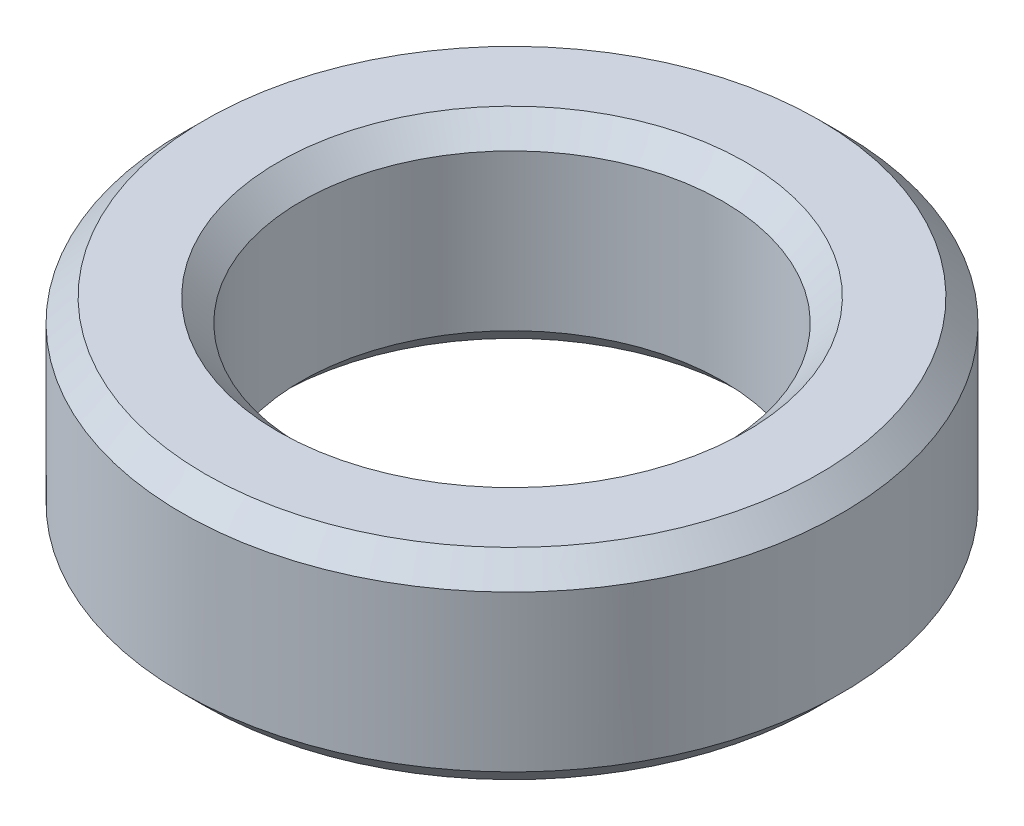
ISO-10303-21;
HEADER;
FILE_DESCRIPTION(('STEP AP214'),'2;1');
FILE_NAME('part.step','',(''),(''),'','','');
FILE_SCHEMA(('AUTOMOTIVE_DESIGN { 1 0 10303 214 1 1 1 1 }'));
ENDSEC;
DATA;
#1=APPLICATION_CONTEXT('core data for automotive mechanical design processes');
#2=APPLICATION_PROTOCOL_DEFINITION('international standard','automotive_design',2000,#1);
#3=PRODUCT_CONTEXT('',#1,'mechanical');
#4=PRODUCT('Part','Part','',(#3));
#5=PRODUCT_RELATED_PRODUCT_CATEGORY('part','',(#4));
#6=PRODUCT_DEFINITION_FORMATION('','',#4);
#7=PRODUCT_DEFINITION_CONTEXT('part definition',#1,'design');
#8=PRODUCT_DEFINITION('design','',#6,#7);
#9=PRODUCT_DEFINITION_SHAPE('','',#8);
#10=(LENGTH_UNIT() NAMED_UNIT(*) SI_UNIT(.MILLI.,.METRE.));
#11=(NAMED_UNIT(*) PLANE_ANGLE_UNIT() SI_UNIT($,.RADIAN.));
#12=(NAMED_UNIT(*) SI_UNIT($,.STERADIAN.) SOLID_ANGLE_UNIT());
#13=UNCERTAINTY_MEASURE_WITH_UNIT(LENGTH_MEASURE(1.E-05),#10,'distance_accuracy_value','');
#14=(GEOMETRIC_REPRESENTATION_CONTEXT(3) GLOBAL_UNCERTAINTY_ASSIGNED_CONTEXT((#13)) GLOBAL_UNIT_ASSIGNED_CONTEXT((#10,
#11,#12)) REPRESENTATION_CONTEXT('',''));
#15=CARTESIAN_POINT('',(0.,0.,0.));
#16=DIRECTION('',(0.,0.,1.));
#17=DIRECTION('',(1.,0.,0.));
#18=AXIS2_PLACEMENT_3D('',#15,#16,#17);
#19=CARTESIAN_POINT('',(0.,13.7321863706491,0.));
#20=DIRECTION('',(0.,-1.,0.));
#21=DIRECTION('',(0.,0.,-1.));
#22=AXIS2_PLACEMENT_3D('',#19,#20,#21);
#23=CYLINDRICAL_SURFACE('',#22,22.5);
#24=CARTESIAN_POINT('',(0.,1.55005661474151,0.));
#25=DIRECTION('',(0.,1.,0.));
#26=DIRECTION('',(0.,0.,1.));
#27=AXIS2_PLACEMENT_3D('',#24,#25,#26);
#28=CIRCLE('',#27,22.5);
#29=CARTESIAN_POINT('',(0.,1.55005661474151,-22.5));
#30=VERTEX_POINT('',#29);
#31=EDGE_CURVE('E10',#30,#30,#28,.T.);
#32=CARTESIAN_POINT('',(0.,12.1821297559076,0.));
#33=DIRECTION('',(0.,1.,0.));
#34=DIRECTION('',(0.,0.,1.));
#35=AXIS2_PLACEMENT_3D('',#32,#33,#34);
#36=CIRCLE('',#35,22.5);
#37=CARTESIAN_POINT('',(0.,12.1821297559076,-22.5));
#38=VERTEX_POINT('',#37);
#39=EDGE_CURVE('E50',#38,#38,#36,.F.);
#40=CARTESIAN_POINT('',(0.,1.55005661474151,-22.5));
#41=CARTESIAN_POINT('',(0.,1.66080737662865,-22.5));
#42=CARTESIAN_POINT('',(0.,1.7715581385158,-22.5));
#43=CARTESIAN_POINT('',(0.,1.99305966229009,-22.5));
#44=CARTESIAN_POINT('',(0.,2.10381042417724,-22.5));
#45=CARTESIAN_POINT('',(0.,2.32531194795153,-22.5));
#46=CARTESIAN_POINT('',(0.,2.43606270983868,-22.5));
#47=CARTESIAN_POINT('',(0.,2.65756423361297,-22.5));
#48=CARTESIAN_POINT('',(0.,2.76831499550012,-22.5));
#49=CARTESIAN_POINT('',(0.,2.98981651927441,-22.5));
#50=CARTESIAN_POINT('',(0.,3.10056728116156,-22.5));
#51=CARTESIAN_POINT('',(0.,3.32206880493586,-22.5));
#52=CARTESIAN_POINT('',(0.,3.432819566823,-22.5));
#53=CARTESIAN_POINT('',(0.,3.6543210905973,-22.5));
#54=CARTESIAN_POINT('',(0.,3.76507185248444,-22.5));
#55=CARTESIAN_POINT('',(0.,3.98657337625873,-22.5));
#56=CARTESIAN_POINT('',(0.,4.09732413814588,-22.5));
#57=CARTESIAN_POINT('',(0.,4.31882566192018,-22.5));
#58=CARTESIAN_POINT('',(0.,4.42957642380732,-22.5));
#59=CARTESIAN_POINT('',(0.,4.65107794758162,-22.5));
#60=CARTESIAN_POINT('',(0.,4.76182870946876,-22.5));
#61=CARTESIAN_POINT('',(0.,4.98333023324306,-22.5));
#62=CARTESIAN_POINT('',(0.,5.0940809951302,-22.5));
#63=CARTESIAN_POINT('',(0.,5.3155825189045,-22.5));
#64=CARTESIAN_POINT('',(0.,5.42633328079164,-22.5));
#65=CARTESIAN_POINT('',(0.,5.64783480456594,-22.5));
#66=CARTESIAN_POINT('',(0.,5.75858556645308,-22.5));
#67=CARTESIAN_POINT('',(0.,5.98008709022738,-22.5));
#68=CARTESIAN_POINT('',(0.,6.09083785211452,-22.5));
#69=CARTESIAN_POINT('',(0.,6.31233937588882,-22.5));
#70=CARTESIAN_POINT('',(0.,6.42309013777596,-22.5));
#71=CARTESIAN_POINT('',(0.,6.64459166155026,-22.5));
#72=CARTESIAN_POINT('',(0.,6.7553424234374,-22.5));
#73=CARTESIAN_POINT('',(0.,6.9768439472117,-22.5));
#74=CARTESIAN_POINT('',(0.,7.08759470909884,-22.5));
#75=CARTESIAN_POINT('',(0.,7.30909623287314,-22.5));
#76=CARTESIAN_POINT('',(0.,7.41984699476028,-22.5));
#77=CARTESIAN_POINT('',(0.,7.64134851853458,-22.5));
#78=CARTESIAN_POINT('',(0.,7.75209928042172,-22.5));
#79=CARTESIAN_POINT('',(0.,7.97360080419602,-22.5));
#80=CARTESIAN_POINT('',(0.,8.08435156608316,-22.5));
#81=CARTESIAN_POINT('',(0.,8.30585308985746,-22.5));
#82=CARTESIAN_POINT('',(0.,8.4166038517446,-22.5));
#83=CARTESIAN_POINT('',(0.,8.6381053755189,-22.5));
#84=CARTESIAN_POINT('',(0.,8.74885613740604,-22.5));
#85=CARTESIAN_POINT('',(0.,8.97035766118034,-22.5));
#86=CARTESIAN_POINT('',(0.,9.08110842306749,-22.5));
#87=CARTESIAN_POINT('',(0.,9.30260994684178,-22.5));
#88=CARTESIAN_POINT('',(0.,9.41336070872893,-22.5));
#89=CARTESIAN_POINT('',(0.,9.63486223250322,-22.5));
#90=CARTESIAN_POINT('',(0.,9.74561299439036,-22.5));
#91=CARTESIAN_POINT('',(0.,9.96711451816466,-22.5));
#92=CARTESIAN_POINT('',(0.,10.0778652800518,-22.5));
#93=CARTESIAN_POINT('',(0.,10.2993668038261,-22.5));
#94=CARTESIAN_POINT('',(0.,10.4101175657132,-22.5));
#95=CARTESIAN_POINT('',(0.,10.6316190894875,-22.5));
#96=CARTESIAN_POINT('',(0.,10.7423698513747,-22.5));
#97=CARTESIAN_POINT('',(0.,10.963871375149,-22.5));
#98=CARTESIAN_POINT('',(0.,11.0746221370361,-22.5));
#99=CARTESIAN_POINT('',(0.,11.2961236608104,-22.5));
#100=CARTESIAN_POINT('',(0.,11.4068744226976,-22.5));
#101=CARTESIAN_POINT('',(0.,11.6283759464719,-22.5));
#102=CARTESIAN_POINT('',(0.,11.739126708359,-22.5));
#103=CARTESIAN_POINT('',(0.,11.9606282321333,-22.5));
#104=CARTESIAN_POINT('',(0.,12.0713789940204,-22.5));
#105=CARTESIAN_POINT('',(0.,12.1821297559076,-22.5));
#106=B_SPLINE_CURVE_WITH_KNOTS('',3,(#40,#41,#42,#43,#44,#45,#46,#47,#48,#49,#50,#51,#52,#53,
#54,#55,#56,#57,#58,#59,#60,#61,#62,#63,#64,#65,#66,#67,#68,#69,#70,#71,#72,#73,#74,#75,#76,#77,
#78,#79,#80,#81,#82,#83,#84,#85,#86,#87,#88,#89,#90,#91,#92,#93,#94,#95,#96,#97,#98,#99,#100,
#101,#102,#103,#104,#105),.UNSPECIFIED.,.F.,.F.,(4,2,2,2,2,2,2,2,2,2,2,2,2,2,2,2,2,2,2,2,2,2,2,
2,2,2,2,2,2,2,2,2,4),(0.,0.332252285661441,0.664504571322881,0.99675685698432,1.32900914264576,
1.6612614283072,1.99351371396864,2.32576599963008,2.65801828529152,2.99027057095296,
3.3225228566144,3.65477514227584,3.98702742793728,4.31927971359872,4.65153199926016,
4.9837842849216,5.31603657058304,5.64828885624448,5.98054114190592,6.31279342756736,
6.6450457132288,6.97729799889024,7.30955028455168,7.64180257021312,7.97405485587456,
8.306307141536,8.63855942719744,8.97081171285888,9.30306399852032,9.63531628418176,
9.9675685698432,10.2998208555046,10.6320731411661),.UNSPECIFIED.);
#107=EDGE_CURVE('BSEAM39',#30,#38,#106,.T.);
#108=ORIENTED_EDGE('',*,*,#31,.T.);
#109=ORIENTED_EDGE('',*,*,#39,.T.);
#110=ORIENTED_EDGE('',*,*,#107,.T.);
#111=ORIENTED_EDGE('',*,*,#107,.F.);
#112=EDGE_LOOP('',(#108,#110,#109,#111));
#113=FACE_BOUND('',#112,.T.);
#114=ADVANCED_FACE('F39',(#113),#23,.T.);
#115=CARTESIAN_POINT('',(0.,13.7321863706491,0.));
#116=DIRECTION('',(0.,1.,0.));
#117=DIRECTION('',(0.,0.,1.));
#118=AXIS2_PLACEMENT_3D('',#115,#116,#117);
#119=PLANE('',#118);
#120=CARTESIAN_POINT('',(0.,13.7321863706491,0.));
#121=DIRECTION('',(0.,1.,0.));
#122=DIRECTION('',(0.,0.,1.));
#123=AXIS2_PLACEMENT_3D('',#120,#121,#122);
#124=CIRCLE('',#123,15.9494271902725);
#125=CARTESIAN_POINT('',(0.,13.7321863706491,15.9494271902725));
#126=VERTEX_POINT('',#125);
#127=EDGE_CURVE('E58',#126,#126,#124,.F.);
#128=ORIENTED_EDGE('',*,*,#127,.T.);
#129=EDGE_LOOP('',(#128));
#130=FACE_BOUND('',#129,.T.);
#131=CARTESIAN_POINT('',(0.,13.7321863706491,0.));
#132=DIRECTION('',(0.,1.,0.));
#133=DIRECTION('',(0.,0.,1.));
#134=AXIS2_PLACEMENT_3D('',#131,#132,#133);
#135=CIRCLE('',#134,20.9499433852586);
#136=CARTESIAN_POINT('',(0.,13.7321863706491,20.9499433852586));
#137=VERTEX_POINT('',#136);
#138=EDGE_CURVE('E61',#137,#137,#135,.T.);
#139=ORIENTED_EDGE('',*,*,#138,.T.);
#140=EDGE_LOOP('',(#139));
#141=FACE_BOUND('',#140,.T.);
#142=ADVANCED_FACE('F88',(#130,#141),#119,.T.);
#143=CARTESIAN_POINT('',(0.,0.,0.));
#144=DIRECTION('',(0.,1.,0.));
#145=DIRECTION('',(0.,0.,1.));
#146=AXIS2_PLACEMENT_3D('',#143,#144,#145);
#147=PLANE('',#146);
#148=CARTESIAN_POINT('',(0.,0.,0.));
#149=DIRECTION('',(0.,1.,0.));
#150=DIRECTION('',(0.,0.,1.));
#151=AXIS2_PLACEMENT_3D('',#148,#149,#150);
#152=CIRCLE('',#151,15.9494271902724);
#153=CARTESIAN_POINT('',(0.,0.,-15.9494271902724));
#154=VERTEX_POINT('',#153);
#155=EDGE_CURVE('E51',#154,#154,#152,.T.);
#156=ORIENTED_EDGE('',*,*,#155,.T.);
#157=EDGE_LOOP('',(#156));
#158=FACE_BOUND('',#157,.T.);
#159=CARTESIAN_POINT('',(0.,0.,0.));
#160=DIRECTION('',(0.,1.,0.));
#161=DIRECTION('',(0.,0.,1.));
#162=AXIS2_PLACEMENT_3D('',#159,#160,#161);
#163=CIRCLE('',#162,20.9499433852585);
#164=CARTESIAN_POINT('',(0.,0.,20.9499433852585));
#165=VERTEX_POINT('',#164);
#166=EDGE_CURVE('E54',#165,#165,#163,.F.);
#167=ORIENTED_EDGE('',*,*,#166,.T.);
#168=EDGE_LOOP('',(#167));
#169=FACE_BOUND('',#168,.T.);
#170=ADVANCED_FACE('F83',(#158,#169),#147,.F.);
#171=CARTESIAN_POINT('',(0.,13.7321863706491,0.));
#172=DIRECTION('',(0.,-1.,0.));
#173=DIRECTION('',(0.,0.,-1.));
#174=AXIS2_PLACEMENT_3D('',#171,#172,#173);
#175=CYLINDRICAL_SURFACE('',#174,14.399370575531);
#176=CARTESIAN_POINT('',(0.,12.1821297559075,0.));
#177=DIRECTION('',(0.,1.,0.));
#178=DIRECTION('',(0.,0.,1.));
#179=AXIS2_PLACEMENT_3D('',#176,#177,#178);
#180=CIRCLE('',#179,14.399370575531);
#181=CARTESIAN_POINT('',(0.,12.1821297559075,-14.399370575531));
#182=VERTEX_POINT('',#181);
#183=EDGE_CURVE('E67',#182,#182,#180,.T.);
#184=CARTESIAN_POINT('',(0.,1.55005661474144,0.));
#185=DIRECTION('',(0.,1.,0.));
#186=DIRECTION('',(0.,0.,1.));
#187=AXIS2_PLACEMENT_3D('',#184,#185,#186);
#188=CIRCLE('',#187,14.399370575531);
#189=CARTESIAN_POINT('',(0.,1.55005661474144,-14.399370575531));
#190=VERTEX_POINT('',#189);
#191=EDGE_CURVE('E69',#190,#190,#188,.F.);
#192=CARTESIAN_POINT('',(0.,12.1821297559075,-14.399370575531));
#193=CARTESIAN_POINT('',(0.,12.0713789940204,-14.399370575531));
#194=CARTESIAN_POINT('',(0.,11.9606282321332,-14.399370575531));
#195=CARTESIAN_POINT('',(0.,11.739126708359,-14.399370575531));
#196=CARTESIAN_POINT('',(0.,11.6283759464718,-14.399370575531));
#197=CARTESIAN_POINT('',(0.,11.4068744226975,-14.399370575531));
#198=CARTESIAN_POINT('',(0.,11.2961236608104,-14.399370575531));
#199=CARTESIAN_POINT('',(0.,11.0746221370361,-14.399370575531));
#200=CARTESIAN_POINT('',(0.,10.9638713751489,-14.399370575531));
#201=CARTESIAN_POINT('',(0.,10.7423698513746,-14.399370575531));
#202=CARTESIAN_POINT('',(0.,10.6316190894875,-14.399370575531));
#203=CARTESIAN_POINT('',(0.,10.4101175657132,-14.399370575531));
#204=CARTESIAN_POINT('',(0.,10.299366803826,-14.399370575531));
#205=CARTESIAN_POINT('',(0.,10.0778652800518,-14.399370575531));
#206=CARTESIAN_POINT('',(0.,9.96711451816461,-14.399370575531));
#207=CARTESIAN_POINT('',(0.,9.74561299439031,-14.399370575531));
#208=CARTESIAN_POINT('',(0.,9.63486223250317,-14.399370575531));
#209=CARTESIAN_POINT('',(0.,9.41336070872887,-14.399370575531));
#210=CARTESIAN_POINT('',(0.,9.30260994684173,-14.399370575531));
#211=CARTESIAN_POINT('',(0.,9.08110842306743,-14.399370575531));
#212=CARTESIAN_POINT('',(0.,8.97035766118028,-14.399370575531));
#213=CARTESIAN_POINT('',(0.,8.74885613740599,-14.399370575531));
#214=CARTESIAN_POINT('',(0.,8.63810537551884,-14.399370575531));
#215=CARTESIAN_POINT('',(0.,8.41660385174455,-14.399370575531));
#216=CARTESIAN_POINT('',(0.,8.3058530898574,-14.399370575531));
#217=CARTESIAN_POINT('',(0.,8.08435156608311,-14.399370575531));
#218=CARTESIAN_POINT('',(0.,7.97360080419596,-14.399370575531));
#219=CARTESIAN_POINT('',(0.,7.75209928042167,-14.399370575531));
#220=CARTESIAN_POINT('',(0.,7.64134851853452,-14.399370575531));
#221=CARTESIAN_POINT('',(0.,7.41984699476023,-14.399370575531));
#222=CARTESIAN_POINT('',(0.,7.30909623287308,-14.399370575531));
#223=CARTESIAN_POINT('',(0.,7.08759470909879,-14.399370575531));
#224=CARTESIAN_POINT('',(0.,6.97684394721164,-14.399370575531));
#225=CARTESIAN_POINT('',(0.,6.75534242343735,-14.399370575531));
#226=CARTESIAN_POINT('',(0.,6.6445916615502,-14.399370575531));
#227=CARTESIAN_POINT('',(0.,6.42309013777591,-14.399370575531));
#228=CARTESIAN_POINT('',(0.,6.31233937588876,-14.399370575531));
#229=CARTESIAN_POINT('',(0.,6.09083785211446,-14.399370575531));
#230=CARTESIAN_POINT('',(0.,5.98008709022732,-14.399370575531));
#231=CARTESIAN_POINT('',(0.,5.75858556645302,-14.399370575531));
#232=CARTESIAN_POINT('',(0.,5.64783480456588,-14.399370575531));
#233=CARTESIAN_POINT('',(0.,5.42633328079158,-14.399370575531));
#234=CARTESIAN_POINT('',(0.,5.31558251890444,-14.399370575531));
#235=CARTESIAN_POINT('',(0.,5.09408099513014,-14.399370575531));
#236=CARTESIAN_POINT('',(0.,4.983330233243,-14.399370575531));
#237=CARTESIAN_POINT('',(0.,4.7618287094687,-14.399370575531));
#238=CARTESIAN_POINT('',(0.,4.65107794758155,-14.399370575531));
#239=CARTESIAN_POINT('',(0.,4.42957642380726,-14.399370575531));
#240=CARTESIAN_POINT('',(0.,4.31882566192011,-14.399370575531));
#241=CARTESIAN_POINT('',(0.,4.09732413814582,-14.399370575531));
#242=CARTESIAN_POINT('',(0.,3.98657337625867,-14.399370575531));
#243=CARTESIAN_POINT('',(0.,3.76507185248438,-14.399370575531));
#244=CARTESIAN_POINT('',(0.,3.65432109059723,-14.399370575531));
#245=CARTESIAN_POINT('',(0.,3.43281956682294,-14.399370575531));
#246=CARTESIAN_POINT('',(0.,3.32206880493579,-14.399370575531));
#247=CARTESIAN_POINT('',(0.,3.1005672811615,-14.399370575531));
#248=CARTESIAN_POINT('',(0.,2.98981651927435,-14.399370575531));
#249=CARTESIAN_POINT('',(0.,2.76831499550006,-14.399370575531));
#250=CARTESIAN_POINT('',(0.,2.65756423361291,-14.399370575531));
#251=CARTESIAN_POINT('',(0.,2.43606270983862,-14.399370575531));
#252=CARTESIAN_POINT('',(0.,2.32531194795147,-14.399370575531));
#253=CARTESIAN_POINT('',(0.,2.10381042417718,-14.399370575531));
#254=CARTESIAN_POINT('',(0.,1.99305966229003,-14.399370575531));
#255=CARTESIAN_POINT('',(0.,1.77155813851573,-14.399370575531));
#256=CARTESIAN_POINT('',(0.,1.66080737662859,-14.399370575531));
#257=CARTESIAN_POINT('',(0.,1.55005661474144,-14.399370575531));
#258=B_SPLINE_CURVE_WITH_KNOTS('',3,(#192,#193,#194,#195,#196,#197,#198,#199,#200,#201,#202,
#203,#204,#205,#206,#207,#208,#209,#210,#211,#212,#213,#214,#215,#216,#217,#218,#219,#220,#221,
#222,#223,#224,#225,#226,#227,#228,#229,#230,#231,#232,#233,#234,#235,#236,#237,#238,#239,#240,
#241,#242,#243,#244,#245,#246,#247,#248,#249,#250,#251,#252,#253,#254,#255,#256,#257),
.UNSPECIFIED.,.F.,.F.,(4,2,2,2,2,2,2,2,2,2,2,2,2,2,2,2,2,2,2,2,2,2,2,2,2,2,2,2,2,2,2,2,4),(0.,
0.332252285661441,0.664504571322881,0.996756856984322,1.32900914264576,1.6612614283072,
1.99351371396864,2.32576599963008,2.65801828529152,2.99027057095297,3.32252285661441,
3.65477514227585,3.98702742793729,4.31927971359873,4.65153199926017,4.98378428492161,
5.31603657058305,5.64828885624449,5.98054114190593,6.31279342756737,6.64504571322881,
6.97729799889025,7.30955028455169,7.64180257021313,7.97405485587458,8.30630714153602,
8.63855942719746,8.9708117128589,9.30306399852034,9.63531628418178,9.96756856984322,
10.2998208555047,10.6320731411661),.UNSPECIFIED.);
#259=EDGE_CURVE('BSEAM71',#182,#190,#258,.T.);
#260=ORIENTED_EDGE('',*,*,#183,.T.);
#261=ORIENTED_EDGE('',*,*,#191,.T.);
#262=ORIENTED_EDGE('',*,*,#259,.T.);
#263=ORIENTED_EDGE('',*,*,#259,.F.);
#264=EDGE_LOOP('',(#260,#262,#261,#263));
#265=FACE_BOUND('',#264,.T.);
#266=ADVANCED_FACE('F71',(#265),#175,.F.);
#267=CARTESIAN_POINT('',(0.,12.1821297559075,0.));
#268=DIRECTION('',(0.,1.,0.));
#269=DIRECTION('',(0.,0.,1.));
#270=AXIS2_PLACEMENT_3D('',#267,#268,#269);
#271=CONICAL_SURFACE('',#270,14.399370575531,0.785398163397454);
#272=ORIENTED_EDGE('',*,*,#127,.F.);
#273=EDGE_LOOP('',(#272));
#274=FACE_BOUND('',#273,.T.);
#275=ORIENTED_EDGE('',*,*,#183,.F.);
#276=EDGE_LOOP('',(#275));
#277=FACE_BOUND('',#276,.T.);
#278=ADVANCED_FACE('F77',(#274,#277),#271,.F.);
#279=CARTESIAN_POINT('',(0.,0.,0.));
#280=DIRECTION('',(0.,-1.,0.));
#281=DIRECTION('',(0.,0.,-1.));
#282=AXIS2_PLACEMENT_3D('',#279,#280,#281);
#283=CONICAL_SURFACE('',#282,15.9494271902724,0.785398163397446);
#284=CARTESIAN_POINT('',(0.,1.55005661474144,-14.399370575531));
#285=CARTESIAN_POINT('',(0.,1.53391019167122,-14.4155169986012));
#286=CARTESIAN_POINT('',(0.,1.517763768601,-14.4316634216714));
#287=CARTESIAN_POINT('',(0.,1.48547092246055,-14.4639562678119));
#288=CARTESIAN_POINT('',(0.,1.46932449939033,-14.4801026908821));
#289=CARTESIAN_POINT('',(0.,1.43703165324988,-14.5123955370225));
#290=CARTESIAN_POINT('',(0.,1.42088523017966,-14.5285419600928));
#291=CARTESIAN_POINT('',(0.,1.38859238403921,-14.5608348062332));
#292=CARTESIAN_POINT('',(0.,1.37244596096899,-14.5769812293034));
#293=CARTESIAN_POINT('',(0.,1.34015311482854,-14.6092740754439));
#294=CARTESIAN_POINT('',(0.,1.32400669175832,-14.6254204985141));
#295=CARTESIAN_POINT('',(0.,1.29171384561787,-14.6577133446545));
#296=CARTESIAN_POINT('',(0.,1.27556742254765,-14.6738597677248));
#297=CARTESIAN_POINT('',(0.,1.2432745764072,-14.7061526138652));
#298=CARTESIAN_POINT('',(0.,1.22712815333698,-14.7222990369354));
#299=CARTESIAN_POINT('',(0.,1.19483530719653,-14.7545918830759));
#300=CARTESIAN_POINT('',(0.,1.17868888412631,-14.7707383061461));
#301=CARTESIAN_POINT('',(0.,1.14639603798586,-14.8030311522865));
#302=CARTESIAN_POINT('',(0.,1.13024961491563,-14.8191775753568));
#303=CARTESIAN_POINT('',(0.,1.09795676877519,-14.8514704214972));
#304=CARTESIAN_POINT('',(0.,1.08181034570497,-14.8676168445674));
#305=CARTESIAN_POINT('',(0.,1.04951749956452,-14.8999096907079));
#306=CARTESIAN_POINT('',(0.,1.03337107649429,-14.9160561137781));
#307=CARTESIAN_POINT('',(0.,1.00107823035385,-14.9483489599186));
#308=CARTESIAN_POINT('',(0.,0.984931807283625,-14.9644953829888));
#309=CARTESIAN_POINT('',(0.,0.952638961143178,-14.9967882291292));
#310=CARTESIAN_POINT('',(0.,0.936492538072955,-15.0129346521995));
#311=CARTESIAN_POINT('',(0.,0.904199691932508,-15.0452274983399));
#312=CARTESIAN_POINT('',(0.,0.888053268862285,-15.0613739214101));
#313=CARTESIAN_POINT('',(0.,0.855760422721838,-15.0936667675506));
#314=CARTESIAN_POINT('',(0.,0.839613999651615,-15.1098131906208));
#315=CARTESIAN_POINT('',(0.,0.807321153511168,-15.1421060367612));
#316=CARTESIAN_POINT('',(0.,0.791174730440945,-15.1582524598315));
#317=CARTESIAN_POINT('',(0.,0.758881884300498,-15.1905453059719));
#318=CARTESIAN_POINT('',(0.,0.742735461230275,-15.2066917290421));
#319=CARTESIAN_POINT('',(0.,0.710442615089828,-15.2389845751826));
#320=CARTESIAN_POINT('',(0.,0.694296192019605,-15.2551309982528));
#321=CARTESIAN_POINT('',(0.,0.662003345879158,-15.2874238443932));
#322=CARTESIAN_POINT('',(0.,0.645856922808934,-15.3035702674635));
#323=CARTESIAN_POINT('',(0.,0.613564076668487,-15.3358631136039));
#324=CARTESIAN_POINT('',(0.,0.597417653598264,-15.3520095366741));
#325=CARTESIAN_POINT('',(0.,0.565124807457818,-15.3843023828146));
#326=CARTESIAN_POINT('',(0.,0.548978384387594,-15.4004488058848));
#327=CARTESIAN_POINT('',(0.,0.516685538247147,-15.4327416520253));
#328=CARTESIAN_POINT('',(0.,0.500539115176924,-15.4488880750955));
#329=CARTESIAN_POINT('',(0.,0.468246269036478,-15.4811809212359));
#330=CARTESIAN_POINT('',(0.,0.452099845966254,-15.4973273443062));
#331=CARTESIAN_POINT('',(0.,0.419806999825808,-15.5296201904466));
#332=CARTESIAN_POINT('',(0.,0.403660576755584,-15.5457666135168));
#333=CARTESIAN_POINT('',(0.,0.371367730615137,-15.5780594596573));
#334=CARTESIAN_POINT('',(0.,0.355221307544913,-15.5942058827275));
#335=CARTESIAN_POINT('',(0.,0.322928461404467,-15.6264987288679));
#336=CARTESIAN_POINT('',(0.,0.306782038334244,-15.6426451519382));
#337=CARTESIAN_POINT('',(0.,0.274489192193798,-15.6749379980786));
#338=CARTESIAN_POINT('',(0.,0.258342769123574,-15.6910844211488));
#339=CARTESIAN_POINT('',(0.,0.226049922983127,-15.7233772672893));
#340=CARTESIAN_POINT('',(0.,0.209903499912903,-15.7395236903595));
#341=CARTESIAN_POINT('',(0.,0.177610653772457,-15.7718165364999));
#342=CARTESIAN_POINT('',(0.,0.161464230702234,-15.7879629595702));
#343=CARTESIAN_POINT('',(0.,0.129171384561787,-15.8202558057106));
#344=CARTESIAN_POINT('',(0.,0.113024961491563,-15.8364022287808));
#345=CARTESIAN_POINT('',(0.,0.0807321153511165,-15.8686950749213));
#346=CARTESIAN_POINT('',(0.,0.0645856922808935,-15.8848414979915));
#347=CARTESIAN_POINT('',(0.,0.0322928461404474,-15.917134344132));
#348=CARTESIAN_POINT('',(0.,0.0161464230702244,-15.9332807672022));
#349=CARTESIAN_POINT('',(0.,0.,-15.9494271902724));
#350=B_SPLINE_CURVE_WITH_KNOTS('',3,(#284,#285,#286,#287,#288,#289,#290,#291,#292,#293,#294,
#295,#296,#297,#298,#299,#300,#301,#302,#303,#304,#305,#306,#307,#308,#309,#310,#311,#312,#313,
#314,#315,#316,#317,#318,#319,#320,#321,#322,#323,#324,#325,#326,#327,#328,#329,#330,#331,#332,
#333,#334,#335,#336,#337,#338,#339,#340,#341,#342,#343,#344,#345,#346,#347,#348,#349),
.UNSPECIFIED.,.F.,.F.,(4,2,2,2,2,2,2,2,2,2,2,2,2,2,2,2,2,2,2,2,2,2,2,2,2,2,2,2,2,2,2,2,4),(0.,
0.0685034714691713,0.137006942938342,0.205510414407512,0.274013885876684,0.342517357345855,
0.411020828815026,0.479524300284197,0.548027771753367,0.616531243222538,0.68503471469171,
0.753538186160881,0.822041657630052,0.890545129099223,0.959048600568393,1.02755207203756,
1.09605554350674,1.16455901497591,1.23306248644508,1.30156595791425,1.37006942938342,
1.43857290085259,1.50707637232176,1.57557984379093,1.6440833152601,1.71258678672927,
1.78109025819845,1.84959372966762,1.91809720113679,1.98660067260596,2.05510414407513,
2.1236076155443,2.19211108701347),.UNSPECIFIED.);
#351=EDGE_CURVE('BSEAM73',#190,#154,#350,.T.);
#352=ORIENTED_EDGE('',*,*,#191,.F.);
#353=ORIENTED_EDGE('',*,*,#155,.F.);
#354=ORIENTED_EDGE('',*,*,#351,.T.);
#355=ORIENTED_EDGE('',*,*,#351,.F.);
#356=EDGE_LOOP('',(#352,#354,#353,#355));
#357=FACE_BOUND('',#356,.T.);
#358=ADVANCED_FACE('F73',(#357),#283,.F.);
#359=CARTESIAN_POINT('',(0.,1.55005661474151,0.));
#360=DIRECTION('',(0.,1.,0.));
#361=DIRECTION('',(0.,0.,1.));
#362=AXIS2_PLACEMENT_3D('',#359,#360,#361);
#363=CONICAL_SURFACE('',#362,22.5,0.785398163397454);
#364=ORIENTED_EDGE('',*,*,#166,.F.);
#365=EDGE_LOOP('',(#364));
#366=FACE_BOUND('',#365,.T.);
#367=ORIENTED_EDGE('',*,*,#31,.F.);
#368=EDGE_LOOP('',(#367));
#369=FACE_BOUND('',#368,.T.);
#370=ADVANCED_FACE('F76',(#366,#369),#363,.T.);
#371=CARTESIAN_POINT('',(0.,13.7321863706491,0.));
#372=DIRECTION('',(0.,-1.,0.));
#373=DIRECTION('',(0.,0.,-1.));
#374=AXIS2_PLACEMENT_3D('',#371,#372,#373);
#375=CONICAL_SURFACE('',#374,20.9499433852586,0.785398163397444);
#376=ORIENTED_EDGE('',*,*,#39,.F.);
#377=EDGE_LOOP('',(#376));
#378=FACE_BOUND('',#377,.T.);
#379=ORIENTED_EDGE('',*,*,#138,.F.);
#380=EDGE_LOOP('',(#379));
#381=FACE_BOUND('',#380,.T.);
#382=ADVANCED_FACE('F45',(#378,#381),#375,.T.);
#383=CLOSED_SHELL('',(#114,#142,#170,#266,#278,#358,#370,#382));
#384=MANIFOLD_SOLID_BREP('B2',#383);
#385=ADVANCED_BREP_SHAPE_REPRESENTATION('',(#18,#384),#14);
#386=SHAPE_DEFINITION_REPRESENTATION(#9,#385);
ENDSEC;
END-ISO-10303-21;
